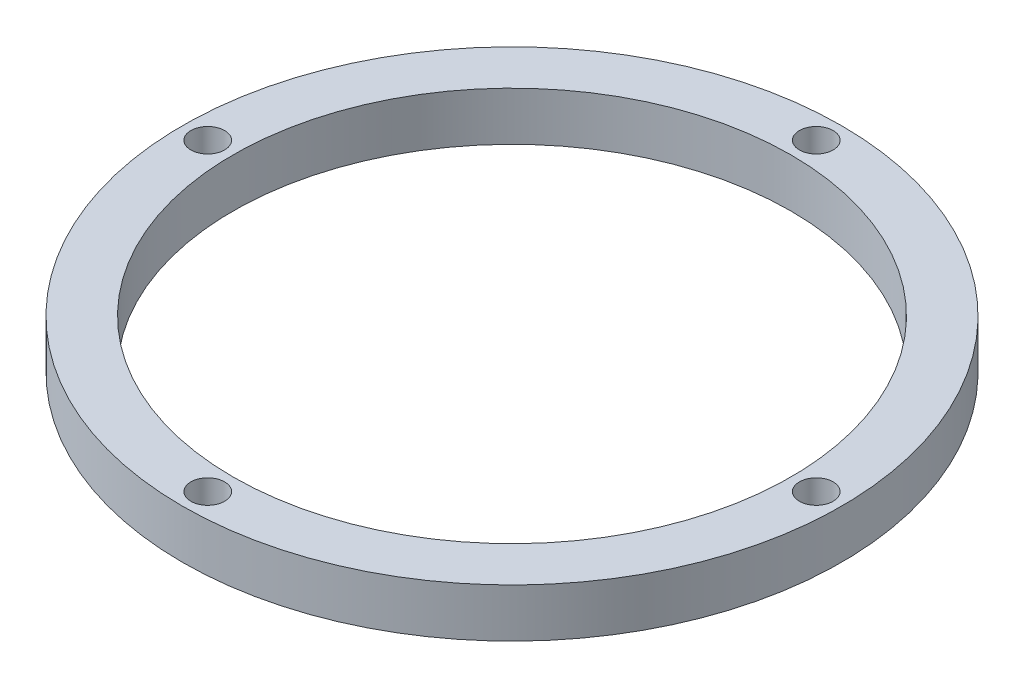
ISO-10303-21;
HEADER;
FILE_DESCRIPTION(('STEP AP214'),'2;1');
FILE_NAME('part.step','',(''),(''),'','','');
FILE_SCHEMA(('AUTOMOTIVE_DESIGN { 1 0 10303 214 1 1 1 1 }'));
ENDSEC;
DATA;
#1=APPLICATION_CONTEXT('core data for automotive mechanical design processes');
#2=APPLICATION_PROTOCOL_DEFINITION('international standard','automotive_design',2000,#1);
#3=PRODUCT_CONTEXT('',#1,'mechanical');
#4=PRODUCT('Part','Part','',(#3));
#5=PRODUCT_RELATED_PRODUCT_CATEGORY('part','',(#4));
#6=PRODUCT_DEFINITION_FORMATION('','',#4);
#7=PRODUCT_DEFINITION_CONTEXT('part definition',#1,'design');
#8=PRODUCT_DEFINITION('design','',#6,#7);
#9=PRODUCT_DEFINITION_SHAPE('','',#8);
#10=(LENGTH_UNIT() NAMED_UNIT(*) SI_UNIT(.MILLI.,.METRE.));
#11=(NAMED_UNIT(*) PLANE_ANGLE_UNIT() SI_UNIT($,.RADIAN.));
#12=(NAMED_UNIT(*) SI_UNIT($,.STERADIAN.) SOLID_ANGLE_UNIT());
#13=UNCERTAINTY_MEASURE_WITH_UNIT(LENGTH_MEASURE(1.E-05),#10,'distance_accuracy_value','');
#14=(GEOMETRIC_REPRESENTATION_CONTEXT(3) GLOBAL_UNCERTAINTY_ASSIGNED_CONTEXT((#13)) GLOBAL_UNIT_ASSIGNED_CONTEXT((#10,
#11,#12)) REPRESENTATION_CONTEXT('',''));
#15=CARTESIAN_POINT('',(0.,0.,0.));
#16=DIRECTION('',(0.,0.,1.));
#17=DIRECTION('',(1.,0.,0.));
#18=AXIS2_PLACEMENT_3D('',#15,#16,#17);
#19=CARTESIAN_POINT('',(0.,4.7625,0.));
#20=DIRECTION('',(0.,1.,0.));
#21=DIRECTION('',(0.,0.,1.));
#22=AXIS2_PLACEMENT_3D('',#19,#20,#21);
#23=PLANE('',#22);
#24=CARTESIAN_POINT('',(29.7815,4.7625,-3.1194465447827E-13));
#25=DIRECTION('',(0.,1.,0.));
#26=DIRECTION('',(-1.,0.,0.));
#27=AXIS2_PLACEMENT_3D('',#24,#25,#26);
#28=CIRCLE('',#27,1.651);
#29=CARTESIAN_POINT('',(28.1305,4.7625,-2.9465134740698E-13));
#30=VERTEX_POINT('',#29);
#31=EDGE_CURVE('E68',#30,#30,#28,.T.);
#32=ORIENTED_EDGE('',*,*,#31,.F.);
#33=EDGE_LOOP('',(#32));
#34=FACE_BOUND('',#33,.T.);
#35=CARTESIAN_POINT('',(0.,4.7625,29.7815));
#36=DIRECTION('',(0.,1.,0.));
#37=DIRECTION('',(0.,0.,-1.));
#38=AXIS2_PLACEMENT_3D('',#35,#36,#37);
#39=CIRCLE('',#38,1.651);
#40=CARTESIAN_POINT('',(0.,4.7625,28.1305));
#41=VERTEX_POINT('',#40);
#42=EDGE_CURVE('E62',#41,#41,#39,.T.);
#43=ORIENTED_EDGE('',*,*,#42,.F.);
#44=EDGE_LOOP('',(#43));
#45=FACE_BOUND('',#44,.T.);
#46=CARTESIAN_POINT('',(-29.7815,4.7625,1.03981551492757E-13));
#47=DIRECTION('',(0.,1.,0.));
#48=DIRECTION('',(1.,0.,0.));
#49=AXIS2_PLACEMENT_3D('',#46,#47,#48);
#50=CIRCLE('',#49,1.651);
#51=CARTESIAN_POINT('',(-28.1305,4.7625,0.));
#52=VERTEX_POINT('',#51);
#53=EDGE_CURVE('E56',#52,#52,#50,.T.);
#54=ORIENTED_EDGE('',*,*,#53,.F.);
#55=EDGE_LOOP('',(#54));
#56=FACE_BOUND('',#55,.T.);
#57=CARTESIAN_POINT('',(0.,4.7625,-29.7815));
#58=DIRECTION('',(0.,1.,0.));
#59=DIRECTION('',(0.,0.,1.));
#60=AXIS2_PLACEMENT_3D('',#57,#58,#59);
#61=CIRCLE('',#60,1.651);
#62=CARTESIAN_POINT('',(0.,4.7625,-28.1305));
#63=VERTEX_POINT('',#62);
#64=EDGE_CURVE('E50',#63,#63,#61,.T.);
#65=ORIENTED_EDGE('',*,*,#64,.F.);
#66=EDGE_LOOP('',(#65));
#67=FACE_BOUND('',#66,.T.);
#68=CARTESIAN_POINT('',(0.,4.7625,0.));
#69=DIRECTION('',(0.,1.,0.));
#70=DIRECTION('',(0.,0.,1.));
#71=AXIS2_PLACEMENT_3D('',#68,#69,#70);
#72=CIRCLE('',#71,32.258);
#73=CARTESIAN_POINT('',(0.,4.7625,32.258));
#74=VERTEX_POINT('',#73);
#75=EDGE_CURVE('E10',#74,#74,#72,.T.);
#76=ORIENTED_EDGE('',*,*,#75,.T.);
#77=EDGE_LOOP('',(#76));
#78=FACE_BOUND('',#77,.T.);
#79=CARTESIAN_POINT('',(0.,4.7625,0.));
#80=DIRECTION('',(0.,1.,0.));
#81=DIRECTION('',(0.,0.,1.));
#82=AXIS2_PLACEMENT_3D('',#79,#80,#81);
#83=CIRCLE('',#82,27.305);
#84=CARTESIAN_POINT('',(0.,4.7625,27.305));
#85=VERTEX_POINT('',#84);
#86=EDGE_CURVE('E42',#85,#85,#83,.T.);
#87=ORIENTED_EDGE('',*,*,#86,.F.);
#88=EDGE_LOOP('',(#87));
#89=FACE_BOUND('',#88,.T.);
#90=ADVANCED_FACE('F31',(#34,#45,#56,#67,#78,#89),#23,.T.);
#91=CARTESIAN_POINT('',(0.,0.,0.));
#92=DIRECTION('',(0.,1.,0.));
#93=DIRECTION('',(0.,0.,1.));
#94=AXIS2_PLACEMENT_3D('',#91,#92,#93);
#95=PLANE('',#94);
#96=CARTESIAN_POINT('',(29.7815,0.,-3.1194465447827E-13));
#97=DIRECTION('',(0.,1.,0.));
#98=DIRECTION('',(-1.,0.,0.));
#99=AXIS2_PLACEMENT_3D('',#96,#97,#98);
#100=CIRCLE('',#99,1.651);
#101=CARTESIAN_POINT('',(28.1305,0.,-2.9465134740698E-13));
#102=VERTEX_POINT('',#101);
#103=EDGE_CURVE('E65',#102,#102,#100,.T.);
#104=ORIENTED_EDGE('',*,*,#103,.T.);
#105=EDGE_LOOP('',(#104));
#106=FACE_BOUND('',#105,.T.);
#107=CARTESIAN_POINT('',(0.,0.,29.7815));
#108=DIRECTION('',(0.,1.,0.));
#109=DIRECTION('',(0.,0.,-1.));
#110=AXIS2_PLACEMENT_3D('',#107,#108,#109);
#111=CIRCLE('',#110,1.651);
#112=CARTESIAN_POINT('',(0.,0.,28.1305));
#113=VERTEX_POINT('',#112);
#114=EDGE_CURVE('E59',#113,#113,#111,.T.);
#115=ORIENTED_EDGE('',*,*,#114,.T.);
#116=EDGE_LOOP('',(#115));
#117=FACE_BOUND('',#116,.T.);
#118=CARTESIAN_POINT('',(-29.7815,0.,1.03981551492757E-13));
#119=DIRECTION('',(0.,1.,0.));
#120=DIRECTION('',(1.,0.,0.));
#121=AXIS2_PLACEMENT_3D('',#118,#119,#120);
#122=CIRCLE('',#121,1.651);
#123=CARTESIAN_POINT('',(-28.1305,0.,0.));
#124=VERTEX_POINT('',#123);
#125=EDGE_CURVE('E53',#124,#124,#122,.T.);
#126=ORIENTED_EDGE('',*,*,#125,.T.);
#127=EDGE_LOOP('',(#126));
#128=FACE_BOUND('',#127,.T.);
#129=CARTESIAN_POINT('',(0.,0.,-29.7815));
#130=DIRECTION('',(0.,1.,0.));
#131=DIRECTION('',(0.,0.,1.));
#132=AXIS2_PLACEMENT_3D('',#129,#130,#131);
#133=CIRCLE('',#132,1.651);
#134=CARTESIAN_POINT('',(0.,0.,-28.1305));
#135=VERTEX_POINT('',#134);
#136=EDGE_CURVE('E47',#135,#135,#133,.T.);
#137=ORIENTED_EDGE('',*,*,#136,.T.);
#138=EDGE_LOOP('',(#137));
#139=FACE_BOUND('',#138,.T.);
#140=CARTESIAN_POINT('',(0.,0.,0.));
#141=DIRECTION('',(0.,1.,0.));
#142=DIRECTION('',(0.,0.,1.));
#143=AXIS2_PLACEMENT_3D('',#140,#141,#142);
#144=CIRCLE('',#143,32.258);
#145=CARTESIAN_POINT('',(0.,0.,32.258));
#146=VERTEX_POINT('',#145);
#147=EDGE_CURVE('E35',#146,#146,#144,.T.);
#148=ORIENTED_EDGE('',*,*,#147,.F.);
#149=EDGE_LOOP('',(#148));
#150=FACE_BOUND('',#149,.T.);
#151=CARTESIAN_POINT('',(0.,0.,0.));
#152=DIRECTION('',(0.,1.,0.));
#153=DIRECTION('',(0.,0.,1.));
#154=AXIS2_PLACEMENT_3D('',#151,#152,#153);
#155=CIRCLE('',#154,27.305);
#156=CARTESIAN_POINT('',(0.,0.,27.305));
#157=VERTEX_POINT('',#156);
#158=EDGE_CURVE('E44',#157,#157,#155,.T.);
#159=ORIENTED_EDGE('',*,*,#158,.T.);
#160=EDGE_LOOP('',(#159));
#161=FACE_BOUND('',#160,.T.);
#162=ADVANCED_FACE('F74',(#106,#117,#128,#139,#150,#161),#95,.F.);
#163=CARTESIAN_POINT('',(0.,4.7625,0.));
#164=DIRECTION('',(0.,-1.,0.));
#165=DIRECTION('',(0.,0.,-1.));
#166=AXIS2_PLACEMENT_3D('',#163,#164,#165);
#167=CYLINDRICAL_SURFACE('',#166,32.258);
#168=ORIENTED_EDGE('',*,*,#75,.F.);
#169=EDGE_LOOP('',(#168));
#170=FACE_BOUND('',#169,.T.);
#171=ORIENTED_EDGE('',*,*,#147,.T.);
#172=EDGE_LOOP('',(#171));
#173=FACE_BOUND('',#172,.T.);
#174=ADVANCED_FACE('F33',(#170,#173),#167,.T.);
#175=CARTESIAN_POINT('',(0.,4.7625,0.));
#176=DIRECTION('',(0.,-1.,0.));
#177=DIRECTION('',(0.,0.,-1.));
#178=AXIS2_PLACEMENT_3D('',#175,#176,#177);
#179=CYLINDRICAL_SURFACE('',#178,27.305);
#180=ORIENTED_EDGE('',*,*,#86,.T.);
#181=EDGE_LOOP('',(#180));
#182=FACE_BOUND('',#181,.T.);
#183=ORIENTED_EDGE('',*,*,#158,.F.);
#184=EDGE_LOOP('',(#183));
#185=FACE_BOUND('',#184,.T.);
#186=ADVANCED_FACE('F95',(#182,#185),#179,.F.);
#187=CARTESIAN_POINT('',(0.,0.,-29.7815));
#188=DIRECTION('',(0.,1.,0.));
#189=DIRECTION('',(0.,0.,1.));
#190=AXIS2_PLACEMENT_3D('',#187,#188,#189);
#191=CYLINDRICAL_SURFACE('',#190,1.651);
#192=ORIENTED_EDGE('',*,*,#136,.F.);
#193=EDGE_LOOP('',(#192));
#194=FACE_BOUND('',#193,.T.);
#195=ORIENTED_EDGE('',*,*,#64,.T.);
#196=EDGE_LOOP('',(#195));
#197=FACE_BOUND('',#196,.T.);
#198=ADVANCED_FACE('F98',(#194,#197),#191,.F.);
#199=CARTESIAN_POINT('',(-29.7815,0.,1.03981551492757E-13));
#200=DIRECTION('',(0.,1.,0.));
#201=DIRECTION('',(0.,0.,1.));
#202=AXIS2_PLACEMENT_3D('',#199,#200,#201);
#203=CYLINDRICAL_SURFACE('',#202,1.651);
#204=ORIENTED_EDGE('',*,*,#125,.F.);
#205=EDGE_LOOP('',(#204));
#206=FACE_BOUND('',#205,.T.);
#207=ORIENTED_EDGE('',*,*,#53,.T.);
#208=EDGE_LOOP('',(#207));
#209=FACE_BOUND('',#208,.T.);
#210=ADVANCED_FACE('F110',(#206,#209),#203,.F.);
#211=CARTESIAN_POINT('',(0.,0.,29.7815));
#212=DIRECTION('',(0.,1.,0.));
#213=DIRECTION('',(0.,0.,1.));
#214=AXIS2_PLACEMENT_3D('',#211,#212,#213);
#215=CYLINDRICAL_SURFACE('',#214,1.651);
#216=ORIENTED_EDGE('',*,*,#114,.F.);
#217=EDGE_LOOP('',(#216));
#218=FACE_BOUND('',#217,.T.);
#219=ORIENTED_EDGE('',*,*,#42,.T.);
#220=EDGE_LOOP('',(#219));
#221=FACE_BOUND('',#220,.T.);
#222=ADVANCED_FACE('F80',(#218,#221),#215,.F.);
#223=CARTESIAN_POINT('',(29.7815,0.,-3.1194465447827E-13));
#224=DIRECTION('',(0.,1.,0.));
#225=DIRECTION('',(0.,0.,1.));
#226=AXIS2_PLACEMENT_3D('',#223,#224,#225);
#227=CYLINDRICAL_SURFACE('',#226,1.651);
#228=ORIENTED_EDGE('',*,*,#103,.F.);
#229=EDGE_LOOP('',(#228));
#230=FACE_BOUND('',#229,.T.);
#231=ORIENTED_EDGE('',*,*,#31,.T.);
#232=EDGE_LOOP('',(#231));
#233=FACE_BOUND('',#232,.T.);
#234=ADVANCED_FACE('F77',(#230,#233),#227,.F.);
#235=CLOSED_SHELL('',(#90,#162,#174,#186,#198,#210,#222,#234));
#236=MANIFOLD_SOLID_BREP('B2',#235);
#237=ADVANCED_BREP_SHAPE_REPRESENTATION('',(#18,#236),#14);
#238=SHAPE_DEFINITION_REPRESENTATION(#9,#237);
ENDSEC;
END-ISO-10303-21;
